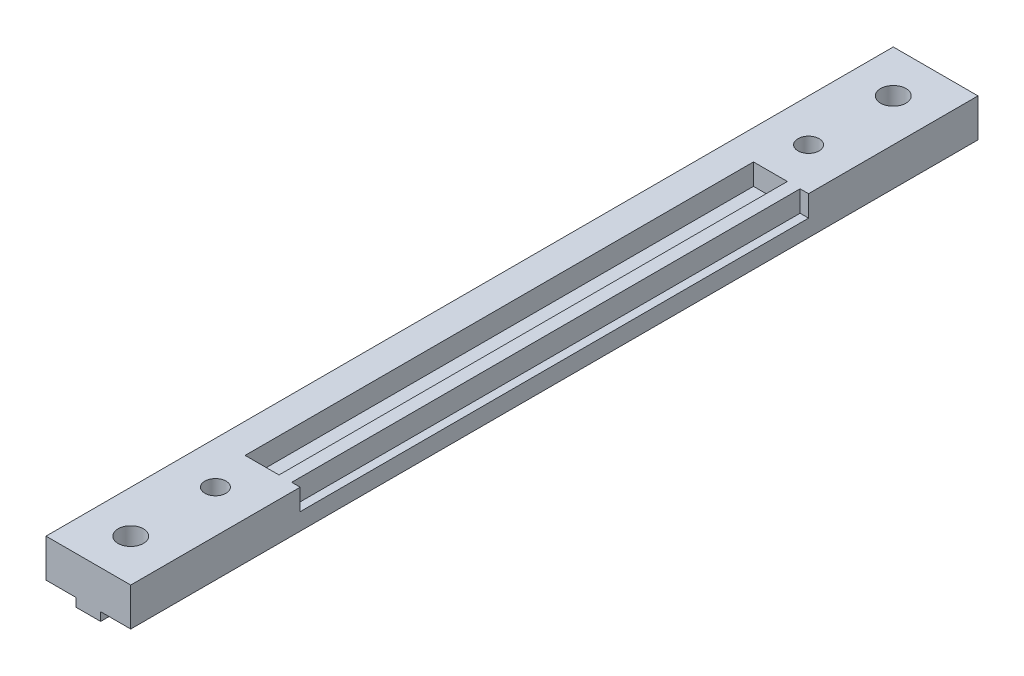
ISO-10303-21;
HEADER;
FILE_DESCRIPTION(('STEP AP214'),'2;1');
FILE_NAME('part.step','',(''),(''),'','','');
FILE_SCHEMA(('AUTOMOTIVE_DESIGN { 1 0 10303 214 1 1 1 1 }'));
ENDSEC;
DATA;
#1=APPLICATION_CONTEXT('core data for automotive mechanical design processes');
#2=APPLICATION_PROTOCOL_DEFINITION('international standard','automotive_design',2000,#1);
#3=PRODUCT_CONTEXT('',#1,'mechanical');
#4=PRODUCT('Part','Part','',(#3));
#5=PRODUCT_RELATED_PRODUCT_CATEGORY('part','',(#4));
#6=PRODUCT_DEFINITION_FORMATION('','',#4);
#7=PRODUCT_DEFINITION_CONTEXT('part definition',#1,'design');
#8=PRODUCT_DEFINITION('design','',#6,#7);
#9=PRODUCT_DEFINITION_SHAPE('','',#8);
#10=(LENGTH_UNIT() NAMED_UNIT(*) SI_UNIT(.MILLI.,.METRE.));
#11=(NAMED_UNIT(*) PLANE_ANGLE_UNIT() SI_UNIT($,.RADIAN.));
#12=(NAMED_UNIT(*) SI_UNIT($,.STERADIAN.) SOLID_ANGLE_UNIT());
#13=UNCERTAINTY_MEASURE_WITH_UNIT(LENGTH_MEASURE(1.E-05),#10,'distance_accuracy_value','');
#14=(GEOMETRIC_REPRESENTATION_CONTEXT(3) GLOBAL_UNCERTAINTY_ASSIGNED_CONTEXT((#13)) GLOBAL_UNIT_ASSIGNED_CONTEXT((#10,
#11,#12)) REPRESENTATION_CONTEXT('',''));
#15=CARTESIAN_POINT('',(0.,0.,0.));
#16=DIRECTION('',(0.,0.,1.));
#17=DIRECTION('',(1.,0.,0.));
#18=AXIS2_PLACEMENT_3D('',#15,#16,#17);
#19=CARTESIAN_POINT('',(-1.45,-5.5,100.));
#20=DIRECTION('',(1.,0.,0.));
#21=DIRECTION('',(0.,1.,0.));
#22=AXIS2_PLACEMENT_3D('',#19,#20,#21);
#23=PLANE('',#22);
#24=DIRECTION('',(0.,0.,-1.));
#25=VECTOR('',#24,1.);
#26=CARTESIAN_POINT('',(-1.45,-5.5,100.));
#27=LINE('',#26,#25);
#28=CARTESIAN_POINT('',(-1.45,-5.5,94.6159427126066));
#29=VERTEX_POINT('',#28);
#30=CARTESIAN_POINT('',(-1.45,-5.5,5.38405728739343));
#31=VERTEX_POINT('',#30);
#32=EDGE_CURVE('E385',#29,#31,#27,.T.);
#33=ORIENTED_EDGE('',*,*,#32,.F.);
#34=DIRECTION('',(0.,1.,0.));
#35=VECTOR('',#34,1.);
#36=CARTESIAN_POINT('',(-1.45,-5.5,94.6159427126066));
#37=LINE('',#36,#35);
#38=CARTESIAN_POINT('',(-1.45,-4.5,94.6159427126066));
#39=VERTEX_POINT('',#38);
#40=EDGE_CURVE('E313',#29,#39,#37,.T.);
#41=ORIENTED_EDGE('',*,*,#40,.T.);
#42=DIRECTION('',(0.,0.,-1.));
#43=VECTOR('',#42,1.);
#44=CARTESIAN_POINT('',(-1.45,-4.5,100.));
#45=LINE('',#44,#43);
#46=CARTESIAN_POINT('',(-1.45,-4.5,5.38405728739343));
#47=VERTEX_POINT('',#46);
#48=EDGE_CURVE('E387',#39,#47,#45,.T.);
#49=ORIENTED_EDGE('',*,*,#48,.T.);
#50=DIRECTION('',(0.,1.,0.));
#51=VECTOR('',#50,1.);
#52=CARTESIAN_POINT('',(-1.45,-5.5,5.38405728739343));
#53=LINE('',#52,#51);
#54=EDGE_CURVE('E289',#47,#31,#53,.F.);
#55=ORIENTED_EDGE('',*,*,#54,.T.);
#56=EDGE_LOOP('',(#33,#41,#49,#55));
#57=FACE_BOUND('',#56,.T.);
#58=ADVANCED_FACE('F33',(#57),#23,.F.);
#59=CARTESIAN_POINT('',(-1.45,-5.5,4.61594271260657));
#60=VERTEX_POINT('',#59);
#61=CARTESIAN_POINT('',(-1.45,-5.5,0.));
#62=VERTEX_POINT('',#61);
#63=EDGE_CURVE('E380',#60,#62,#27,.T.);
#64=ORIENTED_EDGE('',*,*,#63,.F.);
#65=DIRECTION('',(0.,1.,0.));
#66=VECTOR('',#65,1.);
#67=CARTESIAN_POINT('',(-1.45,-5.5,4.61594271260657));
#68=LINE('',#67,#66);
#69=CARTESIAN_POINT('',(-1.45,-4.5,4.61594271260658));
#70=VERTEX_POINT('',#69);
#71=EDGE_CURVE('E295',#60,#70,#68,.T.);
#72=ORIENTED_EDGE('',*,*,#71,.T.);
#73=CARTESIAN_POINT('',(-1.45,-4.5,0.));
#74=VERTEX_POINT('',#73);
#75=EDGE_CURVE('E384',#70,#74,#45,.T.);
#76=ORIENTED_EDGE('',*,*,#75,.T.);
#77=DIRECTION('',(0.,-1.,0.));
#78=VECTOR('',#77,1.);
#79=CARTESIAN_POINT('',(-1.45,-5.5,0.));
#80=LINE('',#79,#78);
#81=EDGE_CURVE('E347',#74,#62,#80,.T.);
#82=ORIENTED_EDGE('',*,*,#81,.T.);
#83=EDGE_LOOP('',(#64,#72,#76,#82));
#84=FACE_BOUND('',#83,.T.);
#85=ADVANCED_FACE('F395',(#84),#23,.F.);
#86=CARTESIAN_POINT('',(1.45,-5.5,100.));
#87=DIRECTION('',(0.,1.,0.));
#88=DIRECTION('',(0.,0.,1.));
#89=AXIS2_PLACEMENT_3D('',#86,#87,#88);
#90=PLANE('',#89);
#91=CARTESIAN_POINT('',(0.,-5.5,85.));
#92=DIRECTION('',(0.,1.,0.));
#93=DIRECTION('',(-1.,0.,0.));
#94=AXIS2_PLACEMENT_3D('',#91,#92,#93);
#95=CIRCLE('',#94,1.25);
#96=CARTESIAN_POINT('',(-1.25,-5.5,85.));
#97=VERTEX_POINT('',#96);
#98=EDGE_CURVE('E317',#97,#97,#95,.T.);
#99=ORIENTED_EDGE('',*,*,#98,.T.);
#100=EDGE_LOOP('',(#99));
#101=FACE_BOUND('',#100,.T.);
#102=CARTESIAN_POINT('',(0.,-5.5,15.));
#103=DIRECTION('',(0.,1.,0.));
#104=DIRECTION('',(-1.,0.,0.));
#105=AXIS2_PLACEMENT_3D('',#102,#103,#104);
#106=CIRCLE('',#105,1.25);
#107=CARTESIAN_POINT('',(-1.25,-5.5,15.));
#108=VERTEX_POINT('',#107);
#109=EDGE_CURVE('E275',#108,#108,#106,.T.);
#110=ORIENTED_EDGE('',*,*,#109,.T.);
#111=EDGE_LOOP('',(#110));
#112=FACE_BOUND('',#111,.T.);
#113=DIRECTION('',(0.,0.,-1.));
#114=VECTOR('',#113,1.);
#115=CARTESIAN_POINT('',(1.45,-5.5,100.));
#116=LINE('',#115,#114);
#117=CARTESIAN_POINT('',(1.45,-5.5,94.6159427126066));
#118=VERTEX_POINT('',#117);
#119=CARTESIAN_POINT('',(1.45,-5.5,5.38405728739344));
#120=VERTEX_POINT('',#119);
#121=EDGE_CURVE('E381',#118,#120,#116,.T.);
#122=ORIENTED_EDGE('',*,*,#121,.F.);
#123=CARTESIAN_POINT('',(0.,-5.5,95.));
#124=DIRECTION('',(0.,1.,0.));
#125=DIRECTION('',(-1.,0.,0.));
#126=AXIS2_PLACEMENT_3D('',#123,#124,#125);
#127=CIRCLE('',#126,1.5);
#128=EDGE_CURVE('E272',#118,#29,#127,.T.);
#129=ORIENTED_EDGE('',*,*,#128,.T.);
#130=ORIENTED_EDGE('',*,*,#32,.T.);
#131=CARTESIAN_POINT('',(0.,-5.5,5.));
#132=DIRECTION('',(0.,1.,0.));
#133=DIRECTION('',(-1.,0.,0.));
#134=AXIS2_PLACEMENT_3D('',#131,#132,#133);
#135=CIRCLE('',#134,1.5);
#136=EDGE_CURVE('E261',#31,#120,#135,.T.);
#137=ORIENTED_EDGE('',*,*,#136,.T.);
#138=EDGE_LOOP('',(#122,#129,#130,#137));
#139=FACE_BOUND('',#138,.T.);
#140=ADVANCED_FACE('F416',(#101,#112,#139),#90,.F.);
#141=CARTESIAN_POINT('',(1.45,-5.5,4.61594271260657));
#142=VERTEX_POINT('',#141);
#143=CARTESIAN_POINT('',(1.45,-5.5,0.));
#144=VERTEX_POINT('',#143);
#145=EDGE_CURVE('E375',#142,#144,#116,.T.);
#146=ORIENTED_EDGE('',*,*,#145,.F.);
#147=EDGE_CURVE('E265',#142,#60,#135,.T.);
#148=ORIENTED_EDGE('',*,*,#147,.T.);
#149=ORIENTED_EDGE('',*,*,#63,.T.);
#150=DIRECTION('',(1.,0.,0.));
#151=VECTOR('',#150,1.);
#152=CARTESIAN_POINT('',(1.45,-5.5,0.));
#153=LINE('',#152,#151);
#154=EDGE_CURVE('E350',#62,#144,#153,.T.);
#155=ORIENTED_EDGE('',*,*,#154,.T.);
#156=EDGE_LOOP('',(#146,#148,#149,#155));
#157=FACE_BOUND('',#156,.T.);
#158=ADVANCED_FACE('F409',(#157),#90,.F.);
#159=CARTESIAN_POINT('',(1.45,-4.5,100.));
#160=DIRECTION('',(-1.,0.,0.));
#161=DIRECTION('',(0.,0.,1.));
#162=AXIS2_PLACEMENT_3D('',#159,#160,#161);
#163=PLANE('',#162);
#164=CARTESIAN_POINT('',(1.45,-5.5,100.));
#165=VERTEX_POINT('',#164);
#166=CARTESIAN_POINT('',(1.45,-5.5,95.3840572873934));
#167=VERTEX_POINT('',#166);
#168=EDGE_CURVE('E377',#165,#167,#116,.T.);
#169=ORIENTED_EDGE('',*,*,#168,.T.);
#170=DIRECTION('',(0.,1.,0.));
#171=VECTOR('',#170,1.);
#172=CARTESIAN_POINT('',(1.45,-5.5,95.3840572873934));
#173=LINE('',#172,#171);
#174=CARTESIAN_POINT('',(1.45,-4.5,95.3840572873934));
#175=VERTEX_POINT('',#174);
#176=EDGE_CURVE('E304',#167,#175,#173,.T.);
#177=ORIENTED_EDGE('',*,*,#176,.T.);
#178=DIRECTION('',(0.,0.,-1.));
#179=VECTOR('',#178,1.);
#180=CARTESIAN_POINT('',(1.45,-4.5,100.));
#181=LINE('',#180,#179);
#182=CARTESIAN_POINT('',(1.45,-4.5,100.));
#183=VERTEX_POINT('',#182);
#184=EDGE_CURVE('E372',#183,#175,#181,.T.);
#185=ORIENTED_EDGE('',*,*,#184,.F.);
#186=DIRECTION('',(0.,1.,0.));
#187=VECTOR('',#186,1.);
#188=CARTESIAN_POINT('',(1.45,-4.5,100.));
#189=LINE('',#188,#187);
#190=EDGE_CURVE('E333',#165,#183,#189,.T.);
#191=ORIENTED_EDGE('',*,*,#190,.F.);
#192=EDGE_LOOP('',(#169,#177,#185,#191));
#193=FACE_BOUND('',#192,.T.);
#194=ADVANCED_FACE('F460',(#193),#163,.F.);
#195=CARTESIAN_POINT('',(1.45,-4.5,94.6159427126066));
#196=VERTEX_POINT('',#195);
#197=CARTESIAN_POINT('',(1.45,-4.5,5.38405728739344));
#198=VERTEX_POINT('',#197);
#199=EDGE_CURVE('E376',#196,#198,#181,.T.);
#200=ORIENTED_EDGE('',*,*,#199,.F.);
#201=DIRECTION('',(0.,1.,0.));
#202=VECTOR('',#201,1.);
#203=CARTESIAN_POINT('',(1.45,-5.5,94.6159427126066));
#204=LINE('',#203,#202);
#205=EDGE_CURVE('E301',#196,#118,#204,.F.);
#206=ORIENTED_EDGE('',*,*,#205,.T.);
#207=ORIENTED_EDGE('',*,*,#121,.T.);
#208=DIRECTION('',(0.,1.,0.));
#209=VECTOR('',#208,1.);
#210=CARTESIAN_POINT('',(1.45,-5.5,5.38405728739344));
#211=LINE('',#210,#209);
#212=EDGE_CURVE('E286',#120,#198,#211,.T.);
#213=ORIENTED_EDGE('',*,*,#212,.T.);
#214=EDGE_LOOP('',(#200,#206,#207,#213));
#215=FACE_BOUND('',#214,.T.);
#216=ADVANCED_FACE('F458',(#215),#163,.F.);
#217=CARTESIAN_POINT('',(-5.,-4.5,100.));
#218=DIRECTION('',(1.,0.,0.));
#219=DIRECTION('',(0.,0.,-1.));
#220=AXIS2_PLACEMENT_3D('',#217,#218,#219);
#221=PLANE('',#220);
#222=DIRECTION('',(0.,-1.,0.));
#223=VECTOR('',#222,1.);
#224=CARTESIAN_POINT('',(-5.,-4.5,0.));
#225=LINE('',#224,#223);
#226=CARTESIAN_POINT('',(-5.,0.,0.));
#227=VERTEX_POINT('',#226);
#228=CARTESIAN_POINT('',(-5.,-4.5,0.));
#229=VERTEX_POINT('',#228);
#230=EDGE_CURVE('E320',#227,#229,#225,.T.);
#231=ORIENTED_EDGE('',*,*,#230,.T.);
#232=DIRECTION('',(0.,0.,-1.));
#233=VECTOR('',#232,1.);
#234=CARTESIAN_POINT('',(-5.,-4.5,100.));
#235=LINE('',#234,#233);
#236=CARTESIAN_POINT('',(-5.,-4.5,100.));
#237=VERTEX_POINT('',#236);
#238=EDGE_CURVE('E11',#237,#229,#235,.T.);
#239=ORIENTED_EDGE('',*,*,#238,.F.);
#240=DIRECTION('',(0.,-1.,0.));
#241=VECTOR('',#240,1.);
#242=CARTESIAN_POINT('',(-5.,-4.5,100.));
#243=LINE('',#242,#241);
#244=CARTESIAN_POINT('',(-5.,0.,100.));
#245=VERTEX_POINT('',#244);
#246=EDGE_CURVE('E323',#245,#237,#243,.T.);
#247=ORIENTED_EDGE('',*,*,#246,.F.);
#248=DIRECTION('',(0.,0.,-1.));
#249=VECTOR('',#248,1.);
#250=CARTESIAN_POINT('',(-5.,0.,100.));
#251=LINE('',#250,#249);
#252=EDGE_CURVE('E341',#245,#227,#251,.T.);
#253=ORIENTED_EDGE('',*,*,#252,.T.);
#254=EDGE_LOOP('',(#231,#239,#247,#253));
#255=FACE_BOUND('',#254,.T.);
#256=ADVANCED_FACE('F35',(#255),#221,.F.);
#257=CARTESIAN_POINT('',(-1.45,-4.5,100.));
#258=DIRECTION('',(0.,1.,0.));
#259=DIRECTION('',(-1.,0.,0.));
#260=AXIS2_PLACEMENT_3D('',#257,#258,#259);
#261=PLANE('',#260);
#262=ORIENTED_EDGE('',*,*,#48,.F.);
#263=CARTESIAN_POINT('',(0.,-4.5,95.));
#264=DIRECTION('',(0.,1.,0.));
#265=DIRECTION('',(-1.,0.,0.));
#266=AXIS2_PLACEMENT_3D('',#263,#264,#265);
#267=CIRCLE('',#266,1.5);
#268=CARTESIAN_POINT('',(-1.45,-4.5,95.3840572873934));
#269=VERTEX_POINT('',#268);
#270=EDGE_CURVE('E310',#39,#269,#267,.T.);
#271=ORIENTED_EDGE('',*,*,#270,.T.);
#272=CARTESIAN_POINT('',(-1.45,-4.5,100.));
#273=VERTEX_POINT('',#272);
#274=EDGE_CURVE('E41',#273,#269,#45,.T.);
#275=ORIENTED_EDGE('',*,*,#274,.F.);
#276=DIRECTION('',(1.,0.,0.));
#277=VECTOR('',#276,1.);
#278=CARTESIAN_POINT('',(-1.45,-4.5,100.));
#279=LINE('',#278,#277);
#280=EDGE_CURVE('E326',#237,#273,#279,.T.);
#281=ORIENTED_EDGE('',*,*,#280,.F.);
#282=ORIENTED_EDGE('',*,*,#238,.T.);
#283=DIRECTION('',(1.,0.,0.));
#284=VECTOR('',#283,1.);
#285=CARTESIAN_POINT('',(-1.45,-4.5,0.));
#286=LINE('',#285,#284);
#287=EDGE_CURVE('E344',#229,#74,#286,.T.);
#288=ORIENTED_EDGE('',*,*,#287,.T.);
#289=ORIENTED_EDGE('',*,*,#75,.F.);
#290=CARTESIAN_POINT('',(0.,-4.5,5.));
#291=DIRECTION('',(0.,1.,0.));
#292=DIRECTION('',(-1.,0.,0.));
#293=AXIS2_PLACEMENT_3D('',#290,#291,#292);
#294=CIRCLE('',#293,1.5);
#295=EDGE_CURVE('E292',#70,#47,#294,.T.);
#296=ORIENTED_EDGE('',*,*,#295,.T.);
#297=EDGE_LOOP('',(#262,#271,#275,#281,#282,#288,#289,#296));
#298=FACE_BOUND('',#297,.T.);
#299=ADVANCED_FACE('F400',(#298),#261,.F.);
#300=ORIENTED_EDGE('',*,*,#274,.T.);
#301=DIRECTION('',(0.,1.,0.));
#302=VECTOR('',#301,1.);
#303=CARTESIAN_POINT('',(-1.45,-5.5,95.3840572873934));
#304=LINE('',#303,#302);
#305=CARTESIAN_POINT('',(-1.45,-5.5,95.3840572873934));
#306=VERTEX_POINT('',#305);
#307=EDGE_CURVE('E307',#269,#306,#304,.F.);
#308=ORIENTED_EDGE('',*,*,#307,.T.);
#309=CARTESIAN_POINT('',(-1.45,-5.5,100.));
#310=VERTEX_POINT('',#309);
#311=EDGE_CURVE('E382',#310,#306,#27,.T.);
#312=ORIENTED_EDGE('',*,*,#311,.F.);
#313=DIRECTION('',(0.,-1.,0.));
#314=VECTOR('',#313,1.);
#315=CARTESIAN_POINT('',(-1.45,-5.5,100.));
#316=LINE('',#315,#314);
#317=EDGE_CURVE('E329',#273,#310,#316,.T.);
#318=ORIENTED_EDGE('',*,*,#317,.F.);
#319=EDGE_LOOP('',(#300,#308,#312,#318));
#320=FACE_BOUND('',#319,.T.);
#321=ADVANCED_FACE('F424',(#320),#23,.F.);
#322=ORIENTED_EDGE('',*,*,#311,.T.);
#323=EDGE_CURVE('E269',#306,#167,#127,.T.);
#324=ORIENTED_EDGE('',*,*,#323,.T.);
#325=ORIENTED_EDGE('',*,*,#168,.F.);
#326=DIRECTION('',(1.,0.,0.));
#327=VECTOR('',#326,1.);
#328=CARTESIAN_POINT('',(1.45,-5.5,100.));
#329=LINE('',#328,#327);
#330=EDGE_CURVE('E331',#310,#165,#329,.T.);
#331=ORIENTED_EDGE('',*,*,#330,.F.);
#332=EDGE_LOOP('',(#322,#324,#325,#331));
#333=FACE_BOUND('',#332,.T.);
#334=ADVANCED_FACE('F427',(#333),#90,.F.);
#335=CARTESIAN_POINT('',(1.45,-4.5,4.61594271260657));
#336=VERTEX_POINT('',#335);
#337=CARTESIAN_POINT('',(1.45,-4.5,0.));
#338=VERTEX_POINT('',#337);
#339=EDGE_CURVE('E371',#336,#338,#181,.T.);
#340=ORIENTED_EDGE('',*,*,#339,.F.);
#341=DIRECTION('',(0.,1.,0.));
#342=VECTOR('',#341,1.);
#343=CARTESIAN_POINT('',(1.45,-5.5,4.61594271260657));
#344=LINE('',#343,#342);
#345=EDGE_CURVE('E283',#336,#142,#344,.F.);
#346=ORIENTED_EDGE('',*,*,#345,.T.);
#347=ORIENTED_EDGE('',*,*,#145,.T.);
#348=DIRECTION('',(0.,1.,0.));
#349=VECTOR('',#348,1.);
#350=CARTESIAN_POINT('',(1.45,-4.5,0.));
#351=LINE('',#350,#349);
#352=EDGE_CURVE('E353',#144,#338,#351,.T.);
#353=ORIENTED_EDGE('',*,*,#352,.T.);
#354=EDGE_LOOP('',(#340,#346,#347,#353));
#355=FACE_BOUND('',#354,.T.);
#356=ADVANCED_FACE('F455',(#355),#163,.F.);
#357=CARTESIAN_POINT('',(5.,-4.5,100.));
#358=DIRECTION('',(0.,1.,0.));
#359=DIRECTION('',(-1.,0.,0.));
#360=AXIS2_PLACEMENT_3D('',#357,#358,#359);
#361=PLANE('',#360);
#362=ORIENTED_EDGE('',*,*,#184,.T.);
#363=CARTESIAN_POINT('',(0.,-4.5,95.));
#364=DIRECTION('',(0.,1.,0.));
#365=DIRECTION('',(-1.,0.,0.));
#366=AXIS2_PLACEMENT_3D('',#363,#364,#365);
#367=CIRCLE('',#366,1.5);
#368=EDGE_CURVE('E298',#175,#196,#367,.T.);
#369=ORIENTED_EDGE('',*,*,#368,.T.);
#370=ORIENTED_EDGE('',*,*,#199,.T.);
#371=CARTESIAN_POINT('',(0.,-4.5,5.));
#372=DIRECTION('',(0.,1.,0.));
#373=DIRECTION('',(-1.,0.,0.));
#374=AXIS2_PLACEMENT_3D('',#371,#372,#373);
#375=CIRCLE('',#374,1.5);
#376=EDGE_CURVE('E278',#198,#336,#375,.T.);
#377=ORIENTED_EDGE('',*,*,#376,.T.);
#378=ORIENTED_EDGE('',*,*,#339,.T.);
#379=DIRECTION('',(1.,0.,0.));
#380=VECTOR('',#379,1.);
#381=CARTESIAN_POINT('',(5.,-4.5,0.));
#382=LINE('',#381,#380);
#383=CARTESIAN_POINT('',(5.,-4.5,0.));
#384=VERTEX_POINT('',#383);
#385=EDGE_CURVE('E356',#338,#384,#382,.T.);
#386=ORIENTED_EDGE('',*,*,#385,.T.);
#387=DIRECTION('',(0.,0.,-1.));
#388=VECTOR('',#387,1.);
#389=CARTESIAN_POINT('',(5.,-4.5,100.));
#390=LINE('',#389,#388);
#391=CARTESIAN_POINT('',(5.,-4.5,100.));
#392=VERTEX_POINT('',#391);
#393=EDGE_CURVE('E368',#392,#384,#390,.T.);
#394=ORIENTED_EDGE('',*,*,#393,.F.);
#395=DIRECTION('',(1.,0.,0.));
#396=VECTOR('',#395,1.);
#397=CARTESIAN_POINT('',(5.,-4.5,100.));
#398=LINE('',#397,#396);
#399=EDGE_CURVE('E335',#183,#392,#398,.T.);
#400=ORIENTED_EDGE('',*,*,#399,.F.);
#401=EDGE_LOOP('',(#362,#369,#370,#377,#378,#386,#394,#400));
#402=FACE_BOUND('',#401,.T.);
#403=ADVANCED_FACE('F451',(#402),#361,.F.);
#404=CARTESIAN_POINT('',(5.,0.,100.));
#405=DIRECTION('',(-1.,0.,0.));
#406=DIRECTION('',(0.,-1.,0.));
#407=AXIS2_PLACEMENT_3D('',#404,#405,#406);
#408=PLANE('',#407);
#409=DIRECTION('',(0.,0.,-1.));
#410=VECTOR('',#409,1.);
#411=CARTESIAN_POINT('',(5.,-2.5,20.));
#412=LINE('',#411,#410);
#413=CARTESIAN_POINT('',(5.00000000000001,-2.5,80.));
#414=VERTEX_POINT('',#413);
#415=CARTESIAN_POINT('',(5.,-2.5,20.));
#416=VERTEX_POINT('',#415);
#417=EDGE_CURVE('E234',#414,#416,#412,.T.);
#418=ORIENTED_EDGE('',*,*,#417,.F.);
#419=DIRECTION('',(0.,1.,0.));
#420=VECTOR('',#419,1.);
#421=CARTESIAN_POINT('',(5.00000000000001,-2.5,80.));
#422=LINE('',#421,#420);
#423=CARTESIAN_POINT('',(5.00000000000001,0.,80.));
#424=VERTEX_POINT('',#423);
#425=EDGE_CURVE('E252',#414,#424,#422,.T.);
#426=ORIENTED_EDGE('',*,*,#425,.T.);
#427=DIRECTION('',(0.,0.,-1.));
#428=VECTOR('',#427,1.);
#429=CARTESIAN_POINT('',(5.,0.,100.));
#430=LINE('',#429,#428);
#431=CARTESIAN_POINT('',(5.,0.,100.));
#432=VERTEX_POINT('',#431);
#433=EDGE_CURVE('E365',#432,#424,#430,.T.);
#434=ORIENTED_EDGE('',*,*,#433,.F.);
#435=DIRECTION('',(0.,1.,0.));
#436=VECTOR('',#435,1.);
#437=CARTESIAN_POINT('',(5.,0.,100.));
#438=LINE('',#437,#436);
#439=EDGE_CURVE('E337',#392,#432,#438,.T.);
#440=ORIENTED_EDGE('',*,*,#439,.F.);
#441=ORIENTED_EDGE('',*,*,#393,.T.);
#442=DIRECTION('',(0.,1.,0.));
#443=VECTOR('',#442,1.);
#444=CARTESIAN_POINT('',(5.,0.,0.));
#445=LINE('',#444,#443);
#446=CARTESIAN_POINT('',(5.,0.,0.));
#447=VERTEX_POINT('',#446);
#448=EDGE_CURVE('E358',#384,#447,#445,.T.);
#449=ORIENTED_EDGE('',*,*,#448,.T.);
#450=CARTESIAN_POINT('',(5.,0.,20.));
#451=VERTEX_POINT('',#450);
#452=EDGE_CURVE('E364',#451,#447,#430,.T.);
#453=ORIENTED_EDGE('',*,*,#452,.F.);
#454=DIRECTION('',(0.,1.,0.));
#455=VECTOR('',#454,1.);
#456=CARTESIAN_POINT('',(5.,-2.5,20.));
#457=LINE('',#456,#455);
#458=EDGE_CURVE('E56',#416,#451,#457,.T.);
#459=ORIENTED_EDGE('',*,*,#458,.F.);
#460=EDGE_LOOP('',(#418,#426,#434,#440,#441,#449,#453,#459));
#461=FACE_BOUND('',#460,.T.);
#462=ADVANCED_FACE('F445',(#461),#408,.F.);
#463=CARTESIAN_POINT('',(-5.,0.,100.));
#464=DIRECTION('',(0.,-1.,0.));
#465=DIRECTION('',(1.,0.,0.));
#466=AXIS2_PLACEMENT_3D('',#463,#464,#465);
#467=PLANE('',#466);
#468=DIRECTION('',(1.,0.,0.));
#469=VECTOR('',#468,1.);
#470=CARTESIAN_POINT('',(-1.49999999999999,0.,80.));
#471=LINE('',#470,#469);
#472=CARTESIAN_POINT('',(-1.49999999999999,0.,80.));
#473=VERTEX_POINT('',#472);
#474=CARTESIAN_POINT('',(2.50000000000001,0.,80.));
#475=VERTEX_POINT('',#474);
#476=EDGE_CURVE('E224',#473,#475,#471,.T.);
#477=ORIENTED_EDGE('',*,*,#476,.F.);
#478=DIRECTION('',(0.,0.,1.));
#479=VECTOR('',#478,1.);
#480=CARTESIAN_POINT('',(-1.5,0.,20.));
#481=LINE('',#480,#479);
#482=CARTESIAN_POINT('',(-1.5,0.,20.));
#483=VERTEX_POINT('',#482);
#484=EDGE_CURVE('E48',#483,#473,#481,.T.);
#485=ORIENTED_EDGE('',*,*,#484,.F.);
#486=DIRECTION('',(-1.,0.,0.));
#487=VECTOR('',#486,1.);
#488=CARTESIAN_POINT('',(-1.5,0.,20.));
#489=LINE('',#488,#487);
#490=CARTESIAN_POINT('',(2.5,0.,20.));
#491=VERTEX_POINT('',#490);
#492=EDGE_CURVE('E215',#491,#483,#489,.T.);
#493=ORIENTED_EDGE('',*,*,#492,.F.);
#494=DIRECTION('',(0.,0.,-1.));
#495=VECTOR('',#494,1.);
#496=CARTESIAN_POINT('',(2.5,0.,20.));
#497=LINE('',#496,#495);
#498=EDGE_CURVE('E218',#475,#491,#497,.T.);
#499=ORIENTED_EDGE('',*,*,#498,.F.);
#500=EDGE_LOOP('',(#477,#485,#493,#499));
#501=FACE_BOUND('',#500,.T.);
#502=CARTESIAN_POINT('',(0.,0.,95.));
#503=DIRECTION('',(0.,1.,0.));
#504=DIRECTION('',(-1.,0.,0.));
#505=AXIS2_PLACEMENT_3D('',#502,#503,#504);
#506=CIRCLE('',#505,1.5);
#507=CARTESIAN_POINT('',(-1.5,0.,95.));
#508=VERTEX_POINT('',#507);
#509=EDGE_CURVE('E255',#508,#508,#506,.T.);
#510=ORIENTED_EDGE('',*,*,#509,.F.);
#511=EDGE_LOOP('',(#510));
#512=FACE_BOUND('',#511,.T.);
#513=CARTESIAN_POINT('',(0.,0.,5.));
#514=DIRECTION('',(0.,1.,0.));
#515=DIRECTION('',(-1.,0.,0.));
#516=AXIS2_PLACEMENT_3D('',#513,#514,#515);
#517=CIRCLE('',#516,1.5);
#518=CARTESIAN_POINT('',(-1.5,0.,5.));
#519=VERTEX_POINT('',#518);
#520=EDGE_CURVE('E266',#519,#519,#517,.T.);
#521=ORIENTED_EDGE('',*,*,#520,.F.);
#522=EDGE_LOOP('',(#521));
#523=FACE_BOUND('',#522,.T.);
#524=CARTESIAN_POINT('',(0.,0.,15.));
#525=DIRECTION('',(0.,1.,0.));
#526=DIRECTION('',(-1.,0.,0.));
#527=AXIS2_PLACEMENT_3D('',#524,#525,#526);
#528=CIRCLE('',#527,1.25);
#529=CARTESIAN_POINT('',(-1.25,0.,15.));
#530=VERTEX_POINT('',#529);
#531=EDGE_CURVE('E264',#530,#530,#528,.T.);
#532=ORIENTED_EDGE('',*,*,#531,.F.);
#533=EDGE_LOOP('',(#532));
#534=FACE_BOUND('',#533,.T.);
#535=CARTESIAN_POINT('',(0.,0.,85.));
#536=DIRECTION('',(0.,1.,0.));
#537=DIRECTION('',(-1.,0.,0.));
#538=AXIS2_PLACEMENT_3D('',#535,#536,#537);
#539=CIRCLE('',#538,1.25);
#540=CARTESIAN_POINT('',(-1.25,0.,85.));
#541=VERTEX_POINT('',#540);
#542=EDGE_CURVE('E316',#541,#541,#539,.T.);
#543=ORIENTED_EDGE('',*,*,#542,.F.);
#544=EDGE_LOOP('',(#543));
#545=FACE_BOUND('',#544,.T.);
#546=ORIENTED_EDGE('',*,*,#433,.T.);
#547=DIRECTION('',(1.,0.,0.));
#548=VECTOR('',#547,1.);
#549=CARTESIAN_POINT('',(5.00000000000001,0.,80.));
#550=LINE('',#549,#548);
#551=CARTESIAN_POINT('',(4.00000000000001,0.,80.));
#552=VERTEX_POINT('',#551);
#553=EDGE_CURVE('E238',#552,#424,#550,.T.);
#554=ORIENTED_EDGE('',*,*,#553,.F.);
#555=DIRECTION('',(0.,0.,1.));
#556=VECTOR('',#555,1.);
#557=CARTESIAN_POINT('',(4.,0.,20.));
#558=LINE('',#557,#556);
#559=CARTESIAN_POINT('',(4.,0.,20.));
#560=VERTEX_POINT('',#559);
#561=EDGE_CURVE('E248',#560,#552,#558,.T.);
#562=ORIENTED_EDGE('',*,*,#561,.F.);
#563=DIRECTION('',(-1.,0.,0.));
#564=VECTOR('',#563,1.);
#565=CARTESIAN_POINT('',(5.,0.,20.));
#566=LINE('',#565,#564);
#567=EDGE_CURVE('E230',#451,#560,#566,.T.);
#568=ORIENTED_EDGE('',*,*,#567,.F.);
#569=ORIENTED_EDGE('',*,*,#452,.T.);
#570=DIRECTION('',(-1.,0.,0.));
#571=VECTOR('',#570,1.);
#572=CARTESIAN_POINT('',(-5.,0.,0.));
#573=LINE('',#572,#571);
#574=EDGE_CURVE('E327',#447,#227,#573,.T.);
#575=ORIENTED_EDGE('',*,*,#574,.T.);
#576=ORIENTED_EDGE('',*,*,#252,.F.);
#577=DIRECTION('',(-1.,0.,0.));
#578=VECTOR('',#577,1.);
#579=CARTESIAN_POINT('',(-5.,0.,100.));
#580=LINE('',#579,#578);
#581=EDGE_CURVE('E339',#432,#245,#580,.T.);
#582=ORIENTED_EDGE('',*,*,#581,.F.);
#583=EDGE_LOOP('',(#546,#554,#562,#568,#569,#575,#576,#582));
#584=FACE_BOUND('',#583,.T.);
#585=ADVANCED_FACE('F440',(#501,#512,#523,#534,#545,#584),#467,.F.);
#586=CARTESIAN_POINT('',(0.,0.,100.));
#587=DIRECTION('',(0.,0.,-1.));
#588=DIRECTION('',(-1.,0.,0.));
#589=AXIS2_PLACEMENT_3D('',#586,#587,#588);
#590=PLANE('',#589);
#591=ORIENTED_EDGE('',*,*,#246,.T.);
#592=ORIENTED_EDGE('',*,*,#280,.T.);
#593=ORIENTED_EDGE('',*,*,#317,.T.);
#594=ORIENTED_EDGE('',*,*,#330,.T.);
#595=ORIENTED_EDGE('',*,*,#190,.T.);
#596=ORIENTED_EDGE('',*,*,#399,.T.);
#597=ORIENTED_EDGE('',*,*,#439,.T.);
#598=ORIENTED_EDGE('',*,*,#581,.T.);
#599=EDGE_LOOP('',(#591,#592,#593,#594,#595,#596,#597,#598));
#600=FACE_BOUND('',#599,.T.);
#601=ADVANCED_FACE('F431',(#600),#590,.F.);
#602=CARTESIAN_POINT('',(0.,0.,0.));
#603=DIRECTION('',(0.,0.,-1.));
#604=DIRECTION('',(-1.,0.,0.));
#605=AXIS2_PLACEMENT_3D('',#602,#603,#604);
#606=PLANE('',#605);
#607=ORIENTED_EDGE('',*,*,#230,.F.);
#608=ORIENTED_EDGE('',*,*,#574,.F.);
#609=ORIENTED_EDGE('',*,*,#448,.F.);
#610=ORIENTED_EDGE('',*,*,#385,.F.);
#611=ORIENTED_EDGE('',*,*,#352,.F.);
#612=ORIENTED_EDGE('',*,*,#154,.F.);
#613=ORIENTED_EDGE('',*,*,#81,.F.);
#614=ORIENTED_EDGE('',*,*,#287,.F.);
#615=EDGE_LOOP('',(#607,#608,#609,#610,#611,#612,#613,#614));
#616=FACE_BOUND('',#615,.T.);
#617=ADVANCED_FACE('F404',(#616),#606,.T.);
#618=CARTESIAN_POINT('',(0.,-5.5,85.));
#619=DIRECTION('',(0.,1.,0.));
#620=DIRECTION('',(-1.,0.,0.));
#621=AXIS2_PLACEMENT_3D('',#618,#619,#620);
#622=CYLINDRICAL_SURFACE('',#621,1.25);
#623=ORIENTED_EDGE('',*,*,#98,.F.);
#624=EDGE_LOOP('',(#623));
#625=FACE_BOUND('',#624,.T.);
#626=ORIENTED_EDGE('',*,*,#542,.T.);
#627=EDGE_LOOP('',(#626));
#628=FACE_BOUND('',#627,.T.);
#629=ADVANCED_FACE('F528',(#625,#628),#622,.F.);
#630=CARTESIAN_POINT('',(0.,-5.5,15.));
#631=DIRECTION('',(0.,1.,0.));
#632=DIRECTION('',(-1.,0.,0.));
#633=AXIS2_PLACEMENT_3D('',#630,#631,#632);
#634=CYLINDRICAL_SURFACE('',#633,1.25);
#635=ORIENTED_EDGE('',*,*,#109,.F.);
#636=EDGE_LOOP('',(#635));
#637=FACE_BOUND('',#636,.T.);
#638=ORIENTED_EDGE('',*,*,#531,.T.);
#639=EDGE_LOOP('',(#638));
#640=FACE_BOUND('',#639,.T.);
#641=ADVANCED_FACE('F533',(#637,#640),#634,.F.);
#642=CARTESIAN_POINT('',(0.,-5.5,5.));
#643=DIRECTION('',(0.,1.,0.));
#644=DIRECTION('',(-1.,0.,0.));
#645=AXIS2_PLACEMENT_3D('',#642,#643,#644);
#646=CYLINDRICAL_SURFACE('',#645,1.5);
#647=ORIENTED_EDGE('',*,*,#520,.T.);
#648=EDGE_LOOP('',(#647));
#649=FACE_BOUND('',#648,.T.);
#650=ORIENTED_EDGE('',*,*,#147,.F.);
#651=ORIENTED_EDGE('',*,*,#345,.F.);
#652=ORIENTED_EDGE('',*,*,#376,.F.);
#653=ORIENTED_EDGE('',*,*,#212,.F.);
#654=ORIENTED_EDGE('',*,*,#136,.F.);
#655=ORIENTED_EDGE('',*,*,#54,.F.);
#656=ORIENTED_EDGE('',*,*,#295,.F.);
#657=ORIENTED_EDGE('',*,*,#71,.F.);
#658=EDGE_LOOP('',(#650,#651,#652,#653,#654,#655,#656,#657));
#659=FACE_BOUND('',#658,.T.);
#660=ADVANCED_FACE('F420',(#649,#659),#646,.F.);
#661=CARTESIAN_POINT('',(0.,-5.5,95.));
#662=DIRECTION('',(0.,1.,0.));
#663=DIRECTION('',(-1.,0.,0.));
#664=AXIS2_PLACEMENT_3D('',#661,#662,#663);
#665=CYLINDRICAL_SURFACE('',#664,1.5);
#666=ORIENTED_EDGE('',*,*,#509,.T.);
#667=EDGE_LOOP('',(#666));
#668=FACE_BOUND('',#667,.T.);
#669=ORIENTED_EDGE('',*,*,#128,.F.);
#670=ORIENTED_EDGE('',*,*,#205,.F.);
#671=ORIENTED_EDGE('',*,*,#368,.F.);
#672=ORIENTED_EDGE('',*,*,#176,.F.);
#673=ORIENTED_EDGE('',*,*,#323,.F.);
#674=ORIENTED_EDGE('',*,*,#307,.F.);
#675=ORIENTED_EDGE('',*,*,#270,.F.);
#676=ORIENTED_EDGE('',*,*,#40,.F.);
#677=EDGE_LOOP('',(#669,#670,#671,#672,#673,#674,#675,#676));
#678=FACE_BOUND('',#677,.T.);
#679=ADVANCED_FACE('F422',(#668,#678),#665,.F.);
#680=CARTESIAN_POINT('',(5.00000000000001,-2.5,80.));
#681=DIRECTION('',(0.,0.,1.));
#682=DIRECTION('',(1.,0.,0.));
#683=AXIS2_PLACEMENT_3D('',#680,#681,#682);
#684=PLANE('',#683);
#685=ORIENTED_EDGE('',*,*,#553,.T.);
#686=ORIENTED_EDGE('',*,*,#425,.F.);
#687=DIRECTION('',(1.,0.,0.));
#688=VECTOR('',#687,1.);
#689=CARTESIAN_POINT('',(5.00000000000001,-2.5,80.));
#690=LINE('',#689,#688);
#691=CARTESIAN_POINT('',(4.00000000000001,-2.5,80.));
#692=VERTEX_POINT('',#691);
#693=EDGE_CURVE('E244',#692,#414,#690,.T.);
#694=ORIENTED_EDGE('',*,*,#693,.F.);
#695=DIRECTION('',(0.,1.,0.));
#696=VECTOR('',#695,1.);
#697=CARTESIAN_POINT('',(4.00000000000001,-2.5,80.));
#698=LINE('',#697,#696);
#699=EDGE_CURVE('E256',#692,#552,#698,.T.);
#700=ORIENTED_EDGE('',*,*,#699,.T.);
#701=EDGE_LOOP('',(#685,#686,#694,#700));
#702=FACE_BOUND('',#701,.T.);
#703=ADVANCED_FACE('F563',(#702),#684,.F.);
#704=CARTESIAN_POINT('',(4.,-2.5,20.));
#705=DIRECTION('',(-1.,0.,0.));
#706=DIRECTION('',(0.,-1.,0.));
#707=AXIS2_PLACEMENT_3D('',#704,#705,#706);
#708=PLANE('',#707);
#709=ORIENTED_EDGE('',*,*,#561,.T.);
#710=ORIENTED_EDGE('',*,*,#699,.F.);
#711=DIRECTION('',(0.,0.,1.));
#712=VECTOR('',#711,1.);
#713=CARTESIAN_POINT('',(4.,-2.5,20.));
#714=LINE('',#713,#712);
#715=CARTESIAN_POINT('',(4.,-2.5,20.));
#716=VERTEX_POINT('',#715);
#717=EDGE_CURVE('E241',#716,#692,#714,.T.);
#718=ORIENTED_EDGE('',*,*,#717,.F.);
#719=DIRECTION('',(0.,1.,0.));
#720=VECTOR('',#719,1.);
#721=CARTESIAN_POINT('',(4.,-2.5,20.));
#722=LINE('',#721,#720);
#723=EDGE_CURVE('E258',#716,#560,#722,.T.);
#724=ORIENTED_EDGE('',*,*,#723,.T.);
#725=EDGE_LOOP('',(#709,#710,#718,#724));
#726=FACE_BOUND('',#725,.T.);
#727=ADVANCED_FACE('F590',(#726),#708,.F.);
#728=CARTESIAN_POINT('',(5.,-2.5,20.));
#729=DIRECTION('',(0.,0.,-1.));
#730=DIRECTION('',(-1.,0.,0.));
#731=AXIS2_PLACEMENT_3D('',#728,#729,#730);
#732=PLANE('',#731);
#733=ORIENTED_EDGE('',*,*,#567,.T.);
#734=ORIENTED_EDGE('',*,*,#723,.F.);
#735=DIRECTION('',(-1.,0.,0.));
#736=VECTOR('',#735,1.);
#737=CARTESIAN_POINT('',(5.,-2.5,20.));
#738=LINE('',#737,#736);
#739=EDGE_CURVE('E237',#416,#716,#738,.T.);
#740=ORIENTED_EDGE('',*,*,#739,.F.);
#741=ORIENTED_EDGE('',*,*,#458,.T.);
#742=EDGE_LOOP('',(#733,#734,#740,#741));
#743=FACE_BOUND('',#742,.T.);
#744=ADVANCED_FACE('F600',(#743),#732,.F.);
#745=CARTESIAN_POINT('',(0.,-2.5,0.));
#746=DIRECTION('',(0.,-1.,0.));
#747=DIRECTION('',(1.,0.,0.));
#748=AXIS2_PLACEMENT_3D('',#745,#746,#747);
#749=PLANE('',#748);
#750=ORIENTED_EDGE('',*,*,#417,.T.);
#751=ORIENTED_EDGE('',*,*,#739,.T.);
#752=ORIENTED_EDGE('',*,*,#717,.T.);
#753=ORIENTED_EDGE('',*,*,#693,.T.);
#754=EDGE_LOOP('',(#750,#751,#752,#753));
#755=FACE_BOUND('',#754,.T.);
#756=ADVANCED_FACE('F610',(#755),#749,.F.);
#757=CARTESIAN_POINT('',(-1.5,-2.5,20.));
#758=DIRECTION('',(-1.,0.,0.));
#759=DIRECTION('',(0.,-1.,0.));
#760=AXIS2_PLACEMENT_3D('',#757,#758,#759);
#761=PLANE('',#760);
#762=ORIENTED_EDGE('',*,*,#484,.T.);
#763=DIRECTION('',(0.,1.,0.));
#764=VECTOR('',#763,1.);
#765=CARTESIAN_POINT('',(-1.49999999999999,-2.5,80.));
#766=LINE('',#765,#764);
#767=CARTESIAN_POINT('',(-1.49999999999999,-2.5,80.));
#768=VERTEX_POINT('',#767);
#769=EDGE_CURVE('E193',#768,#473,#766,.T.);
#770=ORIENTED_EDGE('',*,*,#769,.F.);
#771=DIRECTION('',(0.,0.,1.));
#772=VECTOR('',#771,1.);
#773=CARTESIAN_POINT('',(-1.5,-2.5,20.));
#774=LINE('',#773,#772);
#775=CARTESIAN_POINT('',(-1.5,-2.5,20.));
#776=VERTEX_POINT('',#775);
#777=EDGE_CURVE('E197',#776,#768,#774,.T.);
#778=ORIENTED_EDGE('',*,*,#777,.F.);
#779=DIRECTION('',(0.,1.,0.));
#780=VECTOR('',#779,1.);
#781=CARTESIAN_POINT('',(-1.5,-2.5,20.));
#782=LINE('',#781,#780);
#783=EDGE_CURVE('E228',#776,#483,#782,.T.);
#784=ORIENTED_EDGE('',*,*,#783,.T.);
#785=EDGE_LOOP('',(#762,#770,#778,#784));
#786=FACE_BOUND('',#785,.T.);
#787=ADVANCED_FACE('F195',(#786),#761,.F.);
#788=CARTESIAN_POINT('',(-1.5,-2.5,20.));
#789=DIRECTION('',(0.,0.,-1.));
#790=DIRECTION('',(-1.,0.,0.));
#791=AXIS2_PLACEMENT_3D('',#788,#789,#790);
#792=PLANE('',#791);
#793=ORIENTED_EDGE('',*,*,#492,.T.);
#794=ORIENTED_EDGE('',*,*,#783,.F.);
#795=DIRECTION('',(-1.,0.,0.));
#796=VECTOR('',#795,1.);
#797=CARTESIAN_POINT('',(-1.5,-2.5,20.));
#798=LINE('',#797,#796);
#799=CARTESIAN_POINT('',(2.5,-2.5,20.));
#800=VERTEX_POINT('',#799);
#801=EDGE_CURVE('E203',#800,#776,#798,.T.);
#802=ORIENTED_EDGE('',*,*,#801,.F.);
#803=DIRECTION('',(0.,1.,0.));
#804=VECTOR('',#803,1.);
#805=CARTESIAN_POINT('',(2.5,-2.5,20.));
#806=LINE('',#805,#804);
#807=EDGE_CURVE('E231',#800,#491,#806,.T.);
#808=ORIENTED_EDGE('',*,*,#807,.T.);
#809=EDGE_LOOP('',(#793,#794,#802,#808));
#810=FACE_BOUND('',#809,.T.);
#811=ADVANCED_FACE('F628',(#810),#792,.F.);
#812=CARTESIAN_POINT('',(2.5,-2.5,20.));
#813=DIRECTION('',(1.,0.,0.));
#814=DIRECTION('',(0.,1.,0.));
#815=AXIS2_PLACEMENT_3D('',#812,#813,#814);
#816=PLANE('',#815);
#817=ORIENTED_EDGE('',*,*,#498,.T.);
#818=ORIENTED_EDGE('',*,*,#807,.F.);
#819=DIRECTION('',(0.,0.,-1.));
#820=VECTOR('',#819,1.);
#821=CARTESIAN_POINT('',(2.5,-2.5,20.));
#822=LINE('',#821,#820);
#823=CARTESIAN_POINT('',(2.50000000000001,-2.5,80.));
#824=VERTEX_POINT('',#823);
#825=EDGE_CURVE('E211',#824,#800,#822,.T.);
#826=ORIENTED_EDGE('',*,*,#825,.F.);
#827=DIRECTION('',(0.,1.,0.));
#828=VECTOR('',#827,1.);
#829=CARTESIAN_POINT('',(2.50000000000001,-2.5,80.));
#830=LINE('',#829,#828);
#831=EDGE_CURVE('E202',#824,#475,#830,.T.);
#832=ORIENTED_EDGE('',*,*,#831,.T.);
#833=EDGE_LOOP('',(#817,#818,#826,#832));
#834=FACE_BOUND('',#833,.T.);
#835=ADVANCED_FACE('F637',(#834),#816,.F.);
#836=CARTESIAN_POINT('',(-1.49999999999999,-2.5,80.));
#837=DIRECTION('',(0.,0.,1.));
#838=DIRECTION('',(1.,0.,0.));
#839=AXIS2_PLACEMENT_3D('',#836,#837,#838);
#840=PLANE('',#839);
#841=ORIENTED_EDGE('',*,*,#476,.T.);
#842=ORIENTED_EDGE('',*,*,#831,.F.);
#843=DIRECTION('',(1.,0.,0.));
#844=VECTOR('',#843,1.);
#845=CARTESIAN_POINT('',(-1.49999999999999,-2.5,80.));
#846=LINE('',#845,#844);
#847=EDGE_CURVE('E206',#768,#824,#846,.T.);
#848=ORIENTED_EDGE('',*,*,#847,.F.);
#849=ORIENTED_EDGE('',*,*,#769,.T.);
#850=EDGE_LOOP('',(#841,#842,#848,#849));
#851=FACE_BOUND('',#850,.T.);
#852=ADVANCED_FACE('F207',(#851),#840,.F.);
#853=CARTESIAN_POINT('',(0.,-2.5,0.));
#854=DIRECTION('',(0.,1.,0.));
#855=DIRECTION('',(-1.,0.,0.));
#856=AXIS2_PLACEMENT_3D('',#853,#854,#855);
#857=PLANE('',#856);
#858=ORIENTED_EDGE('',*,*,#777,.T.);
#859=ORIENTED_EDGE('',*,*,#847,.T.);
#860=ORIENTED_EDGE('',*,*,#825,.T.);
#861=ORIENTED_EDGE('',*,*,#801,.T.);
#862=EDGE_LOOP('',(#858,#859,#860,#861));
#863=FACE_BOUND('',#862,.T.);
#864=ADVANCED_FACE('F213',(#863),#857,.T.);
#865=CLOSED_SHELL('',(#58,#85,#140,#158,#194,#216,#256,#299,#321,#334,#356,#403,#462,#585,#601,
#617,#629,#641,#660,#679,#703,#727,#744,#756,#787,#811,#835,#852,#864));
#866=MANIFOLD_SOLID_BREP('B2',#865);
#867=ADVANCED_BREP_SHAPE_REPRESENTATION('',(#18,#866),#14);
#868=SHAPE_DEFINITION_REPRESENTATION(#9,#867);
ENDSEC;
END-ISO-10303-21;
